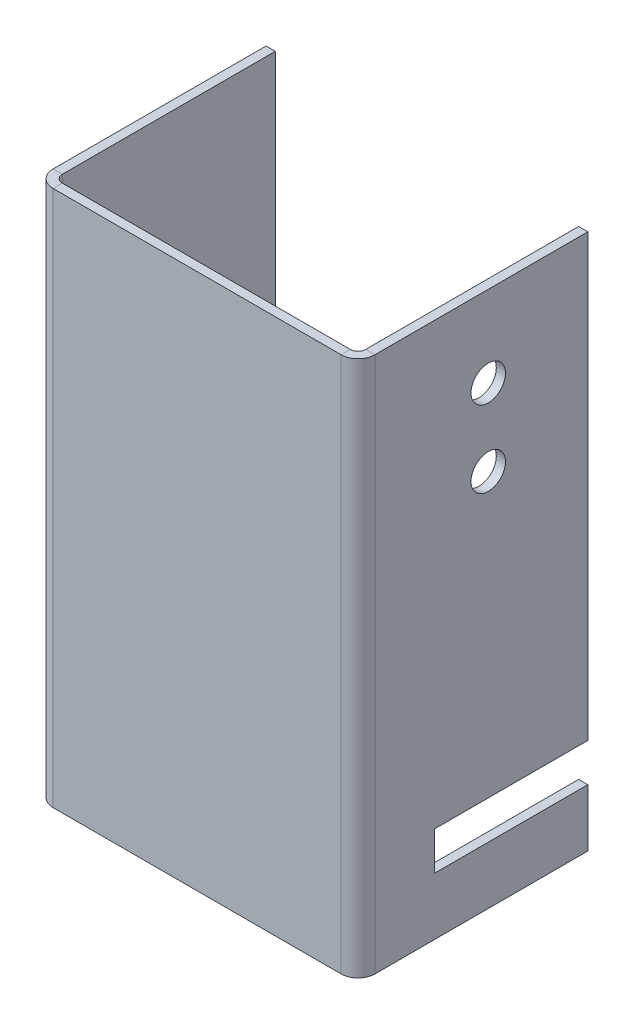
ISO-10303-21;
HEADER;
FILE_DESCRIPTION(('STEP AP214'),'2;1');
FILE_NAME('part.step','',(''),(''),'','','');
FILE_SCHEMA(('AUTOMOTIVE_DESIGN { 1 0 10303 214 1 1 1 1 }'));
ENDSEC;
DATA;
#1=APPLICATION_CONTEXT('core data for automotive mechanical design processes');
#2=APPLICATION_PROTOCOL_DEFINITION('international standard','automotive_design',2000,#1);
#3=PRODUCT_CONTEXT('',#1,'mechanical');
#4=PRODUCT('Part','Part','',(#3));
#5=PRODUCT_RELATED_PRODUCT_CATEGORY('part','',(#4));
#6=PRODUCT_DEFINITION_FORMATION('','',#4);
#7=PRODUCT_DEFINITION_CONTEXT('part definition',#1,'design');
#8=PRODUCT_DEFINITION('design','',#6,#7);
#9=PRODUCT_DEFINITION_SHAPE('','',#8);
#10=(LENGTH_UNIT() NAMED_UNIT(*) SI_UNIT(.MILLI.,.METRE.));
#11=(NAMED_UNIT(*) PLANE_ANGLE_UNIT() SI_UNIT($,.RADIAN.));
#12=(NAMED_UNIT(*) SI_UNIT($,.STERADIAN.) SOLID_ANGLE_UNIT());
#13=UNCERTAINTY_MEASURE_WITH_UNIT(LENGTH_MEASURE(1.E-05),#10,'distance_accuracy_value','');
#14=(GEOMETRIC_REPRESENTATION_CONTEXT(3) GLOBAL_UNCERTAINTY_ASSIGNED_CONTEXT((#13)) GLOBAL_UNIT_ASSIGNED_CONTEXT((#10,
#11,#12)) REPRESENTATION_CONTEXT('',''));
#15=CARTESIAN_POINT('',(0.,0.,0.));
#16=DIRECTION('',(0.,0.,1.));
#17=DIRECTION('',(1.,0.,0.));
#18=AXIS2_PLACEMENT_3D('',#15,#16,#17);
#19=CARTESIAN_POINT('',(42.,70.,-30.));
#20=DIRECTION('',(0.,0.,-1.));
#21=DIRECTION('',(0.,-1.,0.));
#22=AXIS2_PLACEMENT_3D('',#19,#20,#21);
#23=PLANE('',#22);
#24=DIRECTION('',(1.,0.,0.));
#25=VECTOR('',#24,1.);
#26=CARTESIAN_POINT('',(-0.001000000000001,12.5,-30.));
#27=LINE('',#26,#25);
#28=CARTESIAN_POINT('',(40.8,12.5,-30.));
#29=VERTEX_POINT('',#28);
#30=CARTESIAN_POINT('',(42.,12.5,-30.));
#31=VERTEX_POINT('',#30);
#32=EDGE_CURVE('E642',#29,#31,#27,.T.);
#33=ORIENTED_EDGE('',*,*,#32,.F.);
#34=DIRECTION('',(0.,1.,0.));
#35=VECTOR('',#34,1.);
#36=CARTESIAN_POINT('',(40.8,70.,-30.));
#37=LINE('',#36,#35);
#38=CARTESIAN_POINT('',(40.8,70.,-30.));
#39=VERTEX_POINT('',#38);
#40=EDGE_CURVE('E165',#39,#29,#37,.F.);
#41=ORIENTED_EDGE('',*,*,#40,.F.);
#42=DIRECTION('',(1.,0.,0.));
#43=VECTOR('',#42,1.);
#44=CARTESIAN_POINT('',(42.,70.,-30.));
#45=LINE('',#44,#43);
#46=CARTESIAN_POINT('',(42.,70.,-30.));
#47=VERTEX_POINT('',#46);
#48=EDGE_CURVE('E190',#39,#47,#45,.T.);
#49=ORIENTED_EDGE('',*,*,#48,.T.);
#50=DIRECTION('',(0.,-1.,0.));
#51=VECTOR('',#50,1.);
#52=CARTESIAN_POINT('',(42.,70.,-30.));
#53=LINE('',#52,#51);
#54=EDGE_CURVE('E270',#47,#31,#53,.T.);
#55=ORIENTED_EDGE('',*,*,#54,.T.);
#56=EDGE_LOOP('',(#33,#41,#49,#55));
#57=FACE_BOUND('',#56,.T.);
#58=ADVANCED_FACE('F37',(#57),#23,.T.);
#59=CARTESIAN_POINT('',(0.,0.,0.));
#60=DIRECTION('',(0.,1.,0.));
#61=DIRECTION('',(1.,0.,0.));
#62=AXIS2_PLACEMENT_3D('',#59,#60,#61);
#63=PLANE('',#62);
#64=DIRECTION('',(0.,0.,1.));
#65=VECTOR('',#64,1.);
#66=CARTESIAN_POINT('',(2.2,0.,0.));
#67=LINE('',#66,#65);
#68=CARTESIAN_POINT('',(2.2,0.,-1.2));
#69=VERTEX_POINT('',#68);
#70=CARTESIAN_POINT('',(2.2,0.,0.));
#71=VERTEX_POINT('',#70);
#72=EDGE_CURVE('E11',#69,#71,#67,.T.);
#73=ORIENTED_EDGE('',*,*,#72,.F.);
#74=DIRECTION('',(-1.,0.,0.));
#75=VECTOR('',#74,1.);
#76=CARTESIAN_POINT('',(0.,0.,-1.2));
#77=LINE('',#76,#75);
#78=CARTESIAN_POINT('',(39.8,0.,-1.2));
#79=VERTEX_POINT('',#78);
#80=EDGE_CURVE('E151',#69,#79,#77,.F.);
#81=ORIENTED_EDGE('',*,*,#80,.T.);
#82=DIRECTION('',(0.,0.,1.));
#83=VECTOR('',#82,1.);
#84=CARTESIAN_POINT('',(39.8,0.,0.));
#85=LINE('',#84,#83);
#86=CARTESIAN_POINT('',(39.8,0.,0.));
#87=VERTEX_POINT('',#86);
#88=EDGE_CURVE('E46',#79,#87,#85,.T.);
#89=ORIENTED_EDGE('',*,*,#88,.T.);
#90=DIRECTION('',(1.,0.,0.));
#91=VECTOR('',#90,1.);
#92=CARTESIAN_POINT('',(0.,0.,0.));
#93=LINE('',#92,#91);
#94=EDGE_CURVE('E276',#71,#87,#93,.T.);
#95=ORIENTED_EDGE('',*,*,#94,.F.);
#96=EDGE_LOOP('',(#73,#81,#89,#95));
#97=FACE_BOUND('',#96,.T.);
#98=ADVANCED_FACE('F324',(#97),#63,.F.);
#99=CARTESIAN_POINT('',(39.8,0.,-2.2));
#100=DIRECTION('',(0.,1.,0.));
#101=DIRECTION('',(0.,0.,1.));
#102=AXIS2_PLACEMENT_3D('',#99,#100,#101);
#103=PLANE('',#102);
#104=ORIENTED_EDGE('',*,*,#88,.F.);
#105=CARTESIAN_POINT('',(39.8,0.,-2.2));
#106=DIRECTION('',(0.,-1.,0.));
#107=DIRECTION('',(0.,0.,-1.));
#108=AXIS2_PLACEMENT_3D('',#105,#106,#107);
#109=CIRCLE('',#108,1.);
#110=CARTESIAN_POINT('',(40.8,0.,-2.2));
#111=VERTEX_POINT('',#110);
#112=EDGE_CURVE('E161',#79,#111,#109,.F.);
#113=ORIENTED_EDGE('',*,*,#112,.T.);
#114=DIRECTION('',(1.,0.,0.));
#115=VECTOR('',#114,1.);
#116=CARTESIAN_POINT('',(42.,0.,-2.2));
#117=LINE('',#116,#115);
#118=CARTESIAN_POINT('',(42.,0.,-2.2));
#119=VERTEX_POINT('',#118);
#120=EDGE_CURVE('E196',#111,#119,#117,.T.);
#121=ORIENTED_EDGE('',*,*,#120,.T.);
#122=CARTESIAN_POINT('',(39.8,0.,-2.2));
#123=DIRECTION('',(0.,-1.,0.));
#124=DIRECTION('',(0.,0.,-1.));
#125=AXIS2_PLACEMENT_3D('',#122,#123,#124);
#126=CIRCLE('',#125,2.2);
#127=EDGE_CURVE('E204',#87,#119,#126,.F.);
#128=ORIENTED_EDGE('',*,*,#127,.F.);
#129=EDGE_LOOP('',(#104,#113,#121,#128));
#130=FACE_BOUND('',#129,.T.);
#131=ADVANCED_FACE('F203',(#130),#103,.F.);
#132=CARTESIAN_POINT('',(42.,0.,0.));
#133=DIRECTION('',(0.,1.,0.));
#134=DIRECTION('',(0.,0.,-1.));
#135=AXIS2_PLACEMENT_3D('',#132,#133,#134);
#136=PLANE('',#135);
#137=ORIENTED_EDGE('',*,*,#120,.F.);
#138=DIRECTION('',(0.,0.,1.));
#139=VECTOR('',#138,1.);
#140=CARTESIAN_POINT('',(40.8,0.,0.));
#141=LINE('',#140,#139);
#142=CARTESIAN_POINT('',(40.8,0.,-30.));
#143=VERTEX_POINT('',#142);
#144=EDGE_CURVE('E157',#111,#143,#141,.F.);
#145=ORIENTED_EDGE('',*,*,#144,.T.);
#146=DIRECTION('',(1.,0.,0.));
#147=VECTOR('',#146,1.);
#148=CARTESIAN_POINT('',(42.,0.,-30.));
#149=LINE('',#148,#147);
#150=CARTESIAN_POINT('',(42.,0.,-30.));
#151=VERTEX_POINT('',#150);
#152=EDGE_CURVE('E193',#143,#151,#149,.T.);
#153=ORIENTED_EDGE('',*,*,#152,.T.);
#154=DIRECTION('',(0.,0.,-1.));
#155=VECTOR('',#154,1.);
#156=CARTESIAN_POINT('',(42.,0.,0.));
#157=LINE('',#156,#155);
#158=EDGE_CURVE('E223',#119,#151,#157,.T.);
#159=ORIENTED_EDGE('',*,*,#158,.F.);
#160=EDGE_LOOP('',(#137,#145,#153,#159));
#161=FACE_BOUND('',#160,.T.);
#162=ADVANCED_FACE('F224',(#161),#136,.F.);
#163=DIRECTION('',(1.,0.,0.));
#164=VECTOR('',#163,1.);
#165=CARTESIAN_POINT('',(-0.001000000000001,7.5,-30.));
#166=LINE('',#165,#164);
#167=CARTESIAN_POINT('',(40.8,7.50000000000001,-30.));
#168=VERTEX_POINT('',#167);
#169=CARTESIAN_POINT('',(42.,7.5,-30.));
#170=VERTEX_POINT('',#169);
#171=EDGE_CURVE('E53',#168,#170,#166,.T.);
#172=ORIENTED_EDGE('',*,*,#171,.T.);
#173=EDGE_CURVE('E228',#170,#151,#53,.T.);
#174=ORIENTED_EDGE('',*,*,#173,.T.);
#175=ORIENTED_EDGE('',*,*,#152,.F.);
#176=EDGE_CURVE('E168',#168,#143,#37,.F.);
#177=ORIENTED_EDGE('',*,*,#176,.F.);
#178=EDGE_LOOP('',(#172,#174,#175,#177));
#179=FACE_BOUND('',#178,.T.);
#180=ADVANCED_FACE('F265',(#179),#23,.T.);
#181=CARTESIAN_POINT('',(42.,70.,0.));
#182=DIRECTION('',(0.,1.,0.));
#183=DIRECTION('',(0.,0.,-1.));
#184=AXIS2_PLACEMENT_3D('',#181,#182,#183);
#185=PLANE('',#184);
#186=ORIENTED_EDGE('',*,*,#48,.F.);
#187=DIRECTION('',(0.,0.,1.));
#188=VECTOR('',#187,1.);
#189=CARTESIAN_POINT('',(40.8,70.,0.));
#190=LINE('',#189,#188);
#191=CARTESIAN_POINT('',(40.8,70.,-2.2));
#192=VERTEX_POINT('',#191);
#193=EDGE_CURVE('E162',#192,#39,#190,.F.);
#194=ORIENTED_EDGE('',*,*,#193,.F.);
#195=DIRECTION('',(1.,0.,0.));
#196=VECTOR('',#195,1.);
#197=CARTESIAN_POINT('',(42.,70.,-2.2));
#198=LINE('',#197,#196);
#199=CARTESIAN_POINT('',(42.,70.,-2.2));
#200=VERTEX_POINT('',#199);
#201=EDGE_CURVE('E187',#192,#200,#198,.T.);
#202=ORIENTED_EDGE('',*,*,#201,.T.);
#203=DIRECTION('',(0.,0.,-1.));
#204=VECTOR('',#203,1.);
#205=CARTESIAN_POINT('',(42.,70.,0.));
#206=LINE('',#205,#204);
#207=EDGE_CURVE('E236',#200,#47,#206,.T.);
#208=ORIENTED_EDGE('',*,*,#207,.T.);
#209=EDGE_LOOP('',(#186,#194,#202,#208));
#210=FACE_BOUND('',#209,.T.);
#211=ADVANCED_FACE('F315',(#210),#185,.T.);
#212=CARTESIAN_POINT('',(39.8,70.,-2.2));
#213=DIRECTION('',(0.,-1.,0.));
#214=DIRECTION('',(0.,0.,-1.));
#215=AXIS2_PLACEMENT_3D('',#212,#213,#214);
#216=PLANE('',#215);
#217=ORIENTED_EDGE('',*,*,#201,.F.);
#218=CARTESIAN_POINT('',(39.8,70.,-2.2));
#219=DIRECTION('',(0.,-1.,0.));
#220=DIRECTION('',(0.,0.,-1.));
#221=AXIS2_PLACEMENT_3D('',#218,#219,#220);
#222=CIRCLE('',#221,1.);
#223=CARTESIAN_POINT('',(39.8,70.,-1.2));
#224=VERTEX_POINT('',#223);
#225=EDGE_CURVE('E142',#192,#224,#222,.T.);
#226=ORIENTED_EDGE('',*,*,#225,.T.);
#227=DIRECTION('',(0.,0.,1.));
#228=VECTOR('',#227,1.);
#229=CARTESIAN_POINT('',(39.8,70.,0.));
#230=LINE('',#229,#228);
#231=CARTESIAN_POINT('',(39.8,70.,0.));
#232=VERTEX_POINT('',#231);
#233=EDGE_CURVE('E185',#224,#232,#230,.T.);
#234=ORIENTED_EDGE('',*,*,#233,.T.);
#235=CARTESIAN_POINT('',(39.8,70.,-2.2));
#236=DIRECTION('',(0.,1.,0.));
#237=DIRECTION('',(0.,0.,1.));
#238=AXIS2_PLACEMENT_3D('',#235,#236,#237);
#239=CIRCLE('',#238,2.2);
#240=EDGE_CURVE('E219',#200,#232,#239,.F.);
#241=ORIENTED_EDGE('',*,*,#240,.F.);
#242=EDGE_LOOP('',(#217,#226,#234,#241));
#243=FACE_BOUND('',#242,.T.);
#244=ADVANCED_FACE('F317',(#243),#216,.F.);
#245=CARTESIAN_POINT('',(0.,70.,0.));
#246=DIRECTION('',(0.,1.,0.));
#247=DIRECTION('',(1.,0.,0.));
#248=AXIS2_PLACEMENT_3D('',#245,#246,#247);
#249=PLANE('',#248);
#250=ORIENTED_EDGE('',*,*,#233,.F.);
#251=DIRECTION('',(-1.,0.,0.));
#252=VECTOR('',#251,1.);
#253=CARTESIAN_POINT('',(0.,70.,-1.2));
#254=LINE('',#253,#252);
#255=CARTESIAN_POINT('',(2.2,70.,-1.2));
#256=VERTEX_POINT('',#255);
#257=EDGE_CURVE('E146',#256,#224,#254,.F.);
#258=ORIENTED_EDGE('',*,*,#257,.F.);
#259=DIRECTION('',(0.,0.,1.));
#260=VECTOR('',#259,1.);
#261=CARTESIAN_POINT('',(2.2,70.,0.));
#262=LINE('',#261,#260);
#263=CARTESIAN_POINT('',(2.2,70.,0.));
#264=VERTEX_POINT('',#263);
#265=EDGE_CURVE('E182',#256,#264,#262,.T.);
#266=ORIENTED_EDGE('',*,*,#265,.T.);
#267=DIRECTION('',(1.,0.,0.));
#268=VECTOR('',#267,1.);
#269=CARTESIAN_POINT('',(0.,70.,0.));
#270=LINE('',#269,#268);
#271=EDGE_CURVE('E278',#264,#232,#270,.T.);
#272=ORIENTED_EDGE('',*,*,#271,.T.);
#273=EDGE_LOOP('',(#250,#258,#266,#272));
#274=FACE_BOUND('',#273,.T.);
#275=ADVANCED_FACE('F320',(#274),#249,.T.);
#276=CARTESIAN_POINT('',(2.2,70.,-2.2));
#277=DIRECTION('',(0.,-1.,0.));
#278=DIRECTION('',(0.,0.,-1.));
#279=AXIS2_PLACEMENT_3D('',#276,#277,#278);
#280=PLANE('',#279);
#281=ORIENTED_EDGE('',*,*,#265,.F.);
#282=CARTESIAN_POINT('',(2.2,70.,-2.2));
#283=DIRECTION('',(0.,-1.,0.));
#284=DIRECTION('',(0.,0.,-1.));
#285=AXIS2_PLACEMENT_3D('',#282,#283,#284);
#286=CIRCLE('',#285,1.);
#287=CARTESIAN_POINT('',(1.2,70.,-2.2));
#288=VERTEX_POINT('',#287);
#289=EDGE_CURVE('E141',#256,#288,#286,.T.);
#290=ORIENTED_EDGE('',*,*,#289,.T.);
#291=DIRECTION('',(-1.,0.,0.));
#292=VECTOR('',#291,1.);
#293=CARTESIAN_POINT('',(0.,70.,-2.2));
#294=LINE('',#293,#292);
#295=CARTESIAN_POINT('',(0.,70.,-2.2));
#296=VERTEX_POINT('',#295);
#297=EDGE_CURVE('E179',#288,#296,#294,.T.);
#298=ORIENTED_EDGE('',*,*,#297,.T.);
#299=CARTESIAN_POINT('',(2.2,70.,-2.2));
#300=DIRECTION('',(0.,1.,0.));
#301=DIRECTION('',(0.,0.,1.));
#302=AXIS2_PLACEMENT_3D('',#299,#300,#301);
#303=CIRCLE('',#302,2.2);
#304=EDGE_CURVE('E229',#264,#296,#303,.F.);
#305=ORIENTED_EDGE('',*,*,#304,.F.);
#306=EDGE_LOOP('',(#281,#290,#298,#305));
#307=FACE_BOUND('',#306,.T.);
#308=ADVANCED_FACE('F327',(#307),#280,.F.);
#309=CARTESIAN_POINT('',(0.,70.,0.));
#310=DIRECTION('',(0.,1.,0.));
#311=DIRECTION('',(0.,0.,1.));
#312=AXIS2_PLACEMENT_3D('',#309,#310,#311);
#313=PLANE('',#312);
#314=ORIENTED_EDGE('',*,*,#297,.F.);
#315=DIRECTION('',(0.,0.,-1.));
#316=VECTOR('',#315,1.);
#317=CARTESIAN_POINT('',(1.2,70.,0.));
#318=LINE('',#317,#316);
#319=CARTESIAN_POINT('',(1.2,70.,-30.));
#320=VERTEX_POINT('',#319);
#321=EDGE_CURVE('E130',#320,#288,#318,.F.);
#322=ORIENTED_EDGE('',*,*,#321,.F.);
#323=DIRECTION('',(-1.,0.,0.));
#324=VECTOR('',#323,1.);
#325=CARTESIAN_POINT('',(0.,70.,-30.));
#326=LINE('',#325,#324);
#327=CARTESIAN_POINT('',(0.,70.,-30.));
#328=VERTEX_POINT('',#327);
#329=EDGE_CURVE('E176',#320,#328,#326,.T.);
#330=ORIENTED_EDGE('',*,*,#329,.T.);
#331=DIRECTION('',(0.,0.,1.));
#332=VECTOR('',#331,1.);
#333=CARTESIAN_POINT('',(0.,70.,0.));
#334=LINE('',#333,#332);
#335=EDGE_CURVE('E283',#328,#296,#334,.T.);
#336=ORIENTED_EDGE('',*,*,#335,.T.);
#337=EDGE_LOOP('',(#314,#322,#330,#336));
#338=FACE_BOUND('',#337,.T.);
#339=ADVANCED_FACE('F301',(#338),#313,.T.);
#340=CARTESIAN_POINT('',(0.,70.,-30.));
#341=DIRECTION('',(0.,0.,1.));
#342=DIRECTION('',(0.,-1.,0.));
#343=AXIS2_PLACEMENT_3D('',#340,#341,#342);
#344=PLANE('',#343);
#345=ORIENTED_EDGE('',*,*,#329,.F.);
#346=DIRECTION('',(0.,1.,0.));
#347=VECTOR('',#346,1.);
#348=CARTESIAN_POINT('',(1.2,70.,-30.));
#349=LINE('',#348,#347);
#350=CARTESIAN_POINT('',(1.2,0.,-30.));
#351=VERTEX_POINT('',#350);
#352=EDGE_CURVE('E148',#320,#351,#349,.F.);
#353=ORIENTED_EDGE('',*,*,#352,.T.);
#354=DIRECTION('',(-1.,0.,0.));
#355=VECTOR('',#354,1.);
#356=CARTESIAN_POINT('',(0.,0.,-30.));
#357=LINE('',#356,#355);
#358=CARTESIAN_POINT('',(0.,0.,-30.));
#359=VERTEX_POINT('',#358);
#360=EDGE_CURVE('E118',#351,#359,#357,.T.);
#361=ORIENTED_EDGE('',*,*,#360,.T.);
#362=DIRECTION('',(0.,-1.,0.));
#363=VECTOR('',#362,1.);
#364=CARTESIAN_POINT('',(0.,70.,-30.));
#365=LINE('',#364,#363);
#366=EDGE_CURVE('E286',#328,#359,#365,.T.);
#367=ORIENTED_EDGE('',*,*,#366,.F.);
#368=EDGE_LOOP('',(#345,#353,#361,#367));
#369=FACE_BOUND('',#368,.T.);
#370=ADVANCED_FACE('F334',(#369),#344,.F.);
#371=CARTESIAN_POINT('',(0.,0.,0.));
#372=DIRECTION('',(0.,1.,0.));
#373=DIRECTION('',(0.,0.,1.));
#374=AXIS2_PLACEMENT_3D('',#371,#372,#373);
#375=PLANE('',#374);
#376=ORIENTED_EDGE('',*,*,#360,.F.);
#377=DIRECTION('',(0.,0.,-1.));
#378=VECTOR('',#377,1.);
#379=CARTESIAN_POINT('',(1.2,0.,0.));
#380=LINE('',#379,#378);
#381=CARTESIAN_POINT('',(1.2,0.,-2.2));
#382=VERTEX_POINT('',#381);
#383=EDGE_CURVE('E127',#351,#382,#380,.F.);
#384=ORIENTED_EDGE('',*,*,#383,.T.);
#385=DIRECTION('',(-1.,0.,0.));
#386=VECTOR('',#385,1.);
#387=CARTESIAN_POINT('',(0.,0.,-2.2));
#388=LINE('',#387,#386);
#389=CARTESIAN_POINT('',(0.,0.,-2.2));
#390=VERTEX_POINT('',#389);
#391=EDGE_CURVE('E41',#382,#390,#388,.T.);
#392=ORIENTED_EDGE('',*,*,#391,.T.);
#393=DIRECTION('',(0.,0.,1.));
#394=VECTOR('',#393,1.);
#395=CARTESIAN_POINT('',(0.,0.,0.));
#396=LINE('',#395,#394);
#397=EDGE_CURVE('E281',#359,#390,#396,.T.);
#398=ORIENTED_EDGE('',*,*,#397,.F.);
#399=EDGE_LOOP('',(#376,#384,#392,#398));
#400=FACE_BOUND('',#399,.T.);
#401=ADVANCED_FACE('F144',(#400),#375,.F.);
#402=CARTESIAN_POINT('',(2.2,0.,-2.2));
#403=DIRECTION('',(0.,1.,0.));
#404=DIRECTION('',(0.,0.,1.));
#405=AXIS2_PLACEMENT_3D('',#402,#403,#404);
#406=PLANE('',#405);
#407=CARTESIAN_POINT('',(2.2,0.,-2.2));
#408=DIRECTION('',(0.,-1.,0.));
#409=DIRECTION('',(0.,0.,-1.));
#410=AXIS2_PLACEMENT_3D('',#407,#408,#409);
#411=CIRCLE('',#410,1.);
#412=EDGE_CURVE('E109',#382,#69,#411,.F.);
#413=ORIENTED_EDGE('',*,*,#412,.T.);
#414=ORIENTED_EDGE('',*,*,#72,.T.);
#415=CARTESIAN_POINT('',(2.2,0.,-2.2));
#416=DIRECTION('',(0.,-1.,0.));
#417=DIRECTION('',(0.,0.,-1.));
#418=AXIS2_PLACEMENT_3D('',#415,#416,#417);
#419=CIRCLE('',#418,2.2);
#420=EDGE_CURVE('E112',#390,#71,#419,.F.);
#421=ORIENTED_EDGE('',*,*,#420,.F.);
#422=ORIENTED_EDGE('',*,*,#391,.F.);
#423=EDGE_LOOP('',(#413,#414,#421,#422));
#424=FACE_BOUND('',#423,.T.);
#425=ADVANCED_FACE('F39',(#424),#406,.F.);
#426=CARTESIAN_POINT('',(0.,70.,0.));
#427=DIRECTION('',(1.,0.,0.));
#428=DIRECTION('',(0.,0.,-1.));
#429=AXIS2_PLACEMENT_3D('',#426,#427,#428);
#430=PLANE('',#429);
#431=ORIENTED_EDGE('',*,*,#397,.T.);
#432=DIRECTION('',(0.,-1.,0.));
#433=VECTOR('',#432,1.);
#434=CARTESIAN_POINT('',(0.,70.,-2.2));
#435=LINE('',#434,#433);
#436=EDGE_CURVE('E238',#390,#296,#435,.F.);
#437=ORIENTED_EDGE('',*,*,#436,.T.);
#438=ORIENTED_EDGE('',*,*,#335,.F.);
#439=ORIENTED_EDGE('',*,*,#366,.T.);
#440=EDGE_LOOP('',(#431,#437,#438,#439));
#441=FACE_BOUND('',#440,.T.);
#442=ADVANCED_FACE('F305',(#441),#430,.F.);
#443=CARTESIAN_POINT('',(0.,70.,0.));
#444=DIRECTION('',(0.,0.,-1.));
#445=DIRECTION('',(-1.,0.,0.));
#446=AXIS2_PLACEMENT_3D('',#443,#444,#445);
#447=PLANE('',#446);
#448=ORIENTED_EDGE('',*,*,#94,.T.);
#449=DIRECTION('',(0.,-1.,0.));
#450=VECTOR('',#449,1.);
#451=CARTESIAN_POINT('',(39.8,70.,0.));
#452=LINE('',#451,#450);
#453=EDGE_CURVE('E119',#87,#232,#452,.F.);
#454=ORIENTED_EDGE('',*,*,#453,.T.);
#455=ORIENTED_EDGE('',*,*,#271,.F.);
#456=DIRECTION('',(0.,-1.,0.));
#457=VECTOR('',#456,1.);
#458=CARTESIAN_POINT('',(2.2,70.,0.));
#459=LINE('',#458,#457);
#460=EDGE_CURVE('E242',#264,#71,#459,.T.);
#461=ORIENTED_EDGE('',*,*,#460,.T.);
#462=EDGE_LOOP('',(#448,#454,#455,#461));
#463=FACE_BOUND('',#462,.T.);
#464=ADVANCED_FACE('F323',(#463),#447,.F.);
#465=CARTESIAN_POINT('',(42.,70.,0.));
#466=DIRECTION('',(-1.,0.,0.));
#467=DIRECTION('',(0.,0.,1.));
#468=AXIS2_PLACEMENT_3D('',#465,#466,#467);
#469=PLANE('',#468);
#470=CARTESIAN_POINT('',(42.,59.4,-17.));
#471=DIRECTION('',(1.,0.,0.));
#472=DIRECTION('',(0.,0.,-1.));
#473=AXIS2_PLACEMENT_3D('',#470,#471,#472);
#474=CIRCLE('',#473,2.25);
#475=CARTESIAN_POINT('',(42.,59.4,-19.25));
#476=VERTEX_POINT('',#475);
#477=EDGE_CURVE('E173',#476,#476,#474,.T.);
#478=ORIENTED_EDGE('',*,*,#477,.F.);
#479=EDGE_LOOP('',(#478));
#480=FACE_BOUND('',#479,.T.);
#481=CARTESIAN_POINT('',(42.,49.4,-17.));
#482=DIRECTION('',(1.,0.,0.));
#483=DIRECTION('',(0.,0.,-1.));
#484=AXIS2_PLACEMENT_3D('',#481,#482,#483);
#485=CIRCLE('',#484,2.25);
#486=CARTESIAN_POINT('',(42.,49.4,-19.25));
#487=VERTEX_POINT('',#486);
#488=EDGE_CURVE('E658',#487,#487,#485,.T.);
#489=ORIENTED_EDGE('',*,*,#488,.F.);
#490=EDGE_LOOP('',(#489));
#491=FACE_BOUND('',#490,.T.);
#492=DIRECTION('',(0.,-1.,0.));
#493=VECTOR('',#492,1.);
#494=CARTESIAN_POINT('',(42.,12.5,-10.));
#495=LINE('',#494,#493);
#496=CARTESIAN_POINT('',(42.,12.5,-10.));
#497=VERTEX_POINT('',#496);
#498=CARTESIAN_POINT('',(42.,7.5,-10.));
#499=VERTEX_POINT('',#498);
#500=EDGE_CURVE('E636',#497,#499,#495,.T.);
#501=ORIENTED_EDGE('',*,*,#500,.F.);
#502=DIRECTION('',(0.,0.,1.));
#503=VECTOR('',#502,1.);
#504=CARTESIAN_POINT('',(42.,12.5,-30.));
#505=LINE('',#504,#503);
#506=EDGE_CURVE('E640',#31,#497,#505,.T.);
#507=ORIENTED_EDGE('',*,*,#506,.F.);
#508=ORIENTED_EDGE('',*,*,#54,.F.);
#509=ORIENTED_EDGE('',*,*,#207,.F.);
#510=DIRECTION('',(0.,-1.,0.));
#511=VECTOR('',#510,1.);
#512=CARTESIAN_POINT('',(42.,70.,-2.2));
#513=LINE('',#512,#511);
#514=EDGE_CURVE('E217',#200,#119,#513,.T.);
#515=ORIENTED_EDGE('',*,*,#514,.T.);
#516=ORIENTED_EDGE('',*,*,#158,.T.);
#517=ORIENTED_EDGE('',*,*,#173,.F.);
#518=DIRECTION('',(0.,0.,-1.));
#519=VECTOR('',#518,1.);
#520=CARTESIAN_POINT('',(42.,7.5,-30.));
#521=LINE('',#520,#519);
#522=EDGE_CURVE('E628',#499,#170,#521,.T.);
#523=ORIENTED_EDGE('',*,*,#522,.F.);
#524=EDGE_LOOP('',(#501,#507,#508,#509,#515,#516,#517,#523));
#525=FACE_BOUND('',#524,.T.);
#526=ADVANCED_FACE('F233',(#480,#491,#525),#469,.F.);
#527=CARTESIAN_POINT('',(2.2,70.,-2.2));
#528=DIRECTION('',(0.,-1.,0.));
#529=DIRECTION('',(0.,0.,-1.));
#530=AXIS2_PLACEMENT_3D('',#527,#528,#529);
#531=CYLINDRICAL_SURFACE('',#530,2.2);
#532=ORIENTED_EDGE('',*,*,#304,.T.);
#533=ORIENTED_EDGE('',*,*,#436,.F.);
#534=ORIENTED_EDGE('',*,*,#420,.T.);
#535=ORIENTED_EDGE('',*,*,#460,.F.);
#536=EDGE_LOOP('',(#532,#533,#534,#535));
#537=FACE_BOUND('',#536,.T.);
#538=ADVANCED_FACE('F295',(#537),#531,.T.);
#539=CARTESIAN_POINT('',(39.8,70.,-2.2));
#540=DIRECTION('',(0.,-1.,0.));
#541=DIRECTION('',(0.,0.,-1.));
#542=AXIS2_PLACEMENT_3D('',#539,#540,#541);
#543=CYLINDRICAL_SURFACE('',#542,2.2);
#544=ORIENTED_EDGE('',*,*,#240,.T.);
#545=ORIENTED_EDGE('',*,*,#453,.F.);
#546=ORIENTED_EDGE('',*,*,#127,.T.);
#547=ORIENTED_EDGE('',*,*,#514,.F.);
#548=EDGE_LOOP('',(#544,#545,#546,#547));
#549=FACE_BOUND('',#548,.T.);
#550=ADVANCED_FACE('F215',(#549),#543,.T.);
#551=CARTESIAN_POINT('',(1.2,70.,0.));
#552=DIRECTION('',(1.,0.,0.));
#553=DIRECTION('',(0.,0.,-1.));
#554=AXIS2_PLACEMENT_3D('',#551,#552,#553);
#555=PLANE('',#554);
#556=ORIENTED_EDGE('',*,*,#383,.F.);
#557=ORIENTED_EDGE('',*,*,#352,.F.);
#558=ORIENTED_EDGE('',*,*,#321,.T.);
#559=DIRECTION('',(0.,1.,0.));
#560=VECTOR('',#559,1.);
#561=CARTESIAN_POINT('',(1.2,70.,-2.2));
#562=LINE('',#561,#560);
#563=EDGE_CURVE('E124',#382,#288,#562,.T.);
#564=ORIENTED_EDGE('',*,*,#563,.F.);
#565=EDGE_LOOP('',(#556,#557,#558,#564));
#566=FACE_BOUND('',#565,.T.);
#567=ADVANCED_FACE('F125',(#566),#555,.T.);
#568=CARTESIAN_POINT('',(0.,70.,-1.2));
#569=DIRECTION('',(0.,0.,-1.));
#570=DIRECTION('',(-1.,0.,0.));
#571=AXIS2_PLACEMENT_3D('',#568,#569,#570);
#572=PLANE('',#571);
#573=ORIENTED_EDGE('',*,*,#80,.F.);
#574=DIRECTION('',(0.,1.,0.));
#575=VECTOR('',#574,1.);
#576=CARTESIAN_POINT('',(2.2,70.,-1.2));
#577=LINE('',#576,#575);
#578=EDGE_CURVE('E135',#256,#69,#577,.F.);
#579=ORIENTED_EDGE('',*,*,#578,.F.);
#580=ORIENTED_EDGE('',*,*,#257,.T.);
#581=DIRECTION('',(0.,1.,0.));
#582=VECTOR('',#581,1.);
#583=CARTESIAN_POINT('',(39.8,70.,-1.2));
#584=LINE('',#583,#582);
#585=EDGE_CURVE('E220',#79,#224,#584,.T.);
#586=ORIENTED_EDGE('',*,*,#585,.F.);
#587=EDGE_LOOP('',(#573,#579,#580,#586));
#588=FACE_BOUND('',#587,.T.);
#589=ADVANCED_FACE('F326',(#588),#572,.T.);
#590=CARTESIAN_POINT('',(40.8,70.,0.));
#591=DIRECTION('',(-1.,0.,0.));
#592=DIRECTION('',(0.,0.,1.));
#593=AXIS2_PLACEMENT_3D('',#590,#591,#592);
#594=PLANE('',#593);
#595=DIRECTION('',(0.,0.,1.));
#596=VECTOR('',#595,1.);
#597=CARTESIAN_POINT('',(40.8,12.5,-30.));
#598=LINE('',#597,#596);
#599=CARTESIAN_POINT('',(40.8,12.5,-10.));
#600=VERTEX_POINT('',#599);
#601=EDGE_CURVE('E648',#29,#600,#598,.T.);
#602=ORIENTED_EDGE('',*,*,#601,.T.);
#603=DIRECTION('',(0.,-1.,0.));
#604=VECTOR('',#603,1.);
#605=CARTESIAN_POINT('',(40.8,12.5,-10.));
#606=LINE('',#605,#604);
#607=CARTESIAN_POINT('',(40.8,7.5,-10.));
#608=VERTEX_POINT('',#607);
#609=EDGE_CURVE('E670',#600,#608,#606,.T.);
#610=ORIENTED_EDGE('',*,*,#609,.T.);
#611=DIRECTION('',(0.,0.,-1.));
#612=VECTOR('',#611,1.);
#613=CARTESIAN_POINT('',(40.8,7.5,-30.));
#614=LINE('',#613,#612);
#615=EDGE_CURVE('E262',#608,#168,#614,.T.);
#616=ORIENTED_EDGE('',*,*,#615,.T.);
#617=ORIENTED_EDGE('',*,*,#176,.T.);
#618=ORIENTED_EDGE('',*,*,#144,.F.);
#619=DIRECTION('',(0.,1.,0.));
#620=VECTOR('',#619,1.);
#621=CARTESIAN_POINT('',(40.8,70.,-2.2));
#622=LINE('',#621,#620);
#623=EDGE_CURVE('E134',#192,#111,#622,.F.);
#624=ORIENTED_EDGE('',*,*,#623,.F.);
#625=ORIENTED_EDGE('',*,*,#193,.T.);
#626=ORIENTED_EDGE('',*,*,#40,.T.);
#627=EDGE_LOOP('',(#602,#610,#616,#617,#618,#624,#625,#626));
#628=FACE_BOUND('',#627,.T.);
#629=CARTESIAN_POINT('',(40.8,59.4,-17.));
#630=DIRECTION('',(-1.,0.,0.));
#631=DIRECTION('',(0.,0.,1.));
#632=AXIS2_PLACEMENT_3D('',#629,#630,#631);
#633=CIRCLE('',#632,2.25);
#634=CARTESIAN_POINT('',(40.8,59.4,-14.75));
#635=VERTEX_POINT('',#634);
#636=EDGE_CURVE('E655',#635,#635,#633,.F.);
#637=ORIENTED_EDGE('',*,*,#636,.T.);
#638=EDGE_LOOP('',(#637));
#639=FACE_BOUND('',#638,.T.);
#640=CARTESIAN_POINT('',(40.8,49.4,-17.));
#641=DIRECTION('',(-1.,0.,0.));
#642=DIRECTION('',(0.,0.,1.));
#643=AXIS2_PLACEMENT_3D('',#640,#641,#642);
#644=CIRCLE('',#643,2.25);
#645=CARTESIAN_POINT('',(40.8,49.4,-14.75));
#646=VERTEX_POINT('',#645);
#647=EDGE_CURVE('E652',#646,#646,#644,.F.);
#648=ORIENTED_EDGE('',*,*,#647,.T.);
#649=EDGE_LOOP('',(#648));
#650=FACE_BOUND('',#649,.T.);
#651=ADVANCED_FACE('F258',(#628,#639,#650),#594,.T.);
#652=CARTESIAN_POINT('',(2.2,70.,-2.2));
#653=DIRECTION('',(0.,-1.,0.));
#654=DIRECTION('',(0.,0.,-1.));
#655=AXIS2_PLACEMENT_3D('',#652,#653,#654);
#656=CYLINDRICAL_SURFACE('',#655,1.);
#657=ORIENTED_EDGE('',*,*,#289,.F.);
#658=ORIENTED_EDGE('',*,*,#578,.T.);
#659=ORIENTED_EDGE('',*,*,#412,.F.);
#660=ORIENTED_EDGE('',*,*,#563,.T.);
#661=EDGE_LOOP('',(#657,#658,#659,#660));
#662=FACE_BOUND('',#661,.T.);
#663=ADVANCED_FACE('F138',(#662),#656,.F.);
#664=CARTESIAN_POINT('',(39.8,70.,-2.2));
#665=DIRECTION('',(0.,-1.,0.));
#666=DIRECTION('',(0.,0.,-1.));
#667=AXIS2_PLACEMENT_3D('',#664,#665,#666);
#668=CYLINDRICAL_SURFACE('',#667,1.);
#669=ORIENTED_EDGE('',*,*,#225,.F.);
#670=ORIENTED_EDGE('',*,*,#623,.T.);
#671=ORIENTED_EDGE('',*,*,#112,.F.);
#672=ORIENTED_EDGE('',*,*,#585,.T.);
#673=EDGE_LOOP('',(#669,#670,#671,#672));
#674=FACE_BOUND('',#673,.T.);
#675=ADVANCED_FACE('F254',(#674),#668,.F.);
#676=CARTESIAN_POINT('',(-0.001000000000001,49.4,-17.));
#677=DIRECTION('',(1.,0.,0.));
#678=DIRECTION('',(0.,0.,-1.));
#679=AXIS2_PLACEMENT_3D('',#676,#677,#678);
#680=CYLINDRICAL_SURFACE('',#679,2.25);
#681=ORIENTED_EDGE('',*,*,#647,.F.);
#682=EDGE_LOOP('',(#681));
#683=FACE_BOUND('',#682,.T.);
#684=ORIENTED_EDGE('',*,*,#488,.T.);
#685=EDGE_LOOP('',(#684));
#686=FACE_BOUND('',#685,.T.);
#687=ADVANCED_FACE('F552',(#683,#686),#680,.F.);
#688=CARTESIAN_POINT('',(-0.001000000000001,59.4,-17.));
#689=DIRECTION('',(1.,0.,0.));
#690=DIRECTION('',(0.,0.,-1.));
#691=AXIS2_PLACEMENT_3D('',#688,#689,#690);
#692=CYLINDRICAL_SURFACE('',#691,2.25);
#693=ORIENTED_EDGE('',*,*,#636,.F.);
#694=EDGE_LOOP('',(#693));
#695=FACE_BOUND('',#694,.T.);
#696=ORIENTED_EDGE('',*,*,#477,.T.);
#697=EDGE_LOOP('',(#696));
#698=FACE_BOUND('',#697,.T.);
#699=ADVANCED_FACE('F561',(#695,#698),#692,.F.);
#700=CARTESIAN_POINT('',(-0.001000000000001,12.5,-30.));
#701=DIRECTION('',(0.,1.,0.));
#702=DIRECTION('',(0.,0.,1.));
#703=AXIS2_PLACEMENT_3D('',#700,#701,#702);
#704=PLANE('',#703);
#705=ORIENTED_EDGE('',*,*,#32,.T.);
#706=ORIENTED_EDGE('',*,*,#506,.T.);
#707=DIRECTION('',(1.,0.,0.));
#708=VECTOR('',#707,1.);
#709=CARTESIAN_POINT('',(-0.001000000000001,12.5,-10.));
#710=LINE('',#709,#708);
#711=EDGE_CURVE('E633',#600,#497,#710,.T.);
#712=ORIENTED_EDGE('',*,*,#711,.F.);
#713=ORIENTED_EDGE('',*,*,#601,.F.);
#714=EDGE_LOOP('',(#705,#706,#712,#713));
#715=FACE_BOUND('',#714,.T.);
#716=ADVANCED_FACE('F570',(#715),#704,.F.);
#717=CARTESIAN_POINT('',(-0.001000000000001,12.5,-10.));
#718=DIRECTION('',(0.,0.,1.));
#719=DIRECTION('',(1.,0.,0.));
#720=AXIS2_PLACEMENT_3D('',#717,#718,#719);
#721=PLANE('',#720);
#722=ORIENTED_EDGE('',*,*,#711,.T.);
#723=ORIENTED_EDGE('',*,*,#500,.T.);
#724=DIRECTION('',(1.,0.,0.));
#725=VECTOR('',#724,1.);
#726=CARTESIAN_POINT('',(-0.001000000000001,7.5,-10.));
#727=LINE('',#726,#725);
#728=EDGE_CURVE('E626',#608,#499,#727,.T.);
#729=ORIENTED_EDGE('',*,*,#728,.F.);
#730=ORIENTED_EDGE('',*,*,#609,.F.);
#731=EDGE_LOOP('',(#722,#723,#729,#730));
#732=FACE_BOUND('',#731,.T.);
#733=ADVANCED_FACE('F585',(#732),#721,.F.);
#734=CARTESIAN_POINT('',(-0.001000000000001,7.5,-30.));
#735=DIRECTION('',(0.,-1.,0.));
#736=DIRECTION('',(0.,0.,-1.));
#737=AXIS2_PLACEMENT_3D('',#734,#735,#736);
#738=PLANE('',#737);
#739=ORIENTED_EDGE('',*,*,#728,.T.);
#740=ORIENTED_EDGE('',*,*,#522,.T.);
#741=ORIENTED_EDGE('',*,*,#171,.F.);
#742=ORIENTED_EDGE('',*,*,#615,.F.);
#743=EDGE_LOOP('',(#739,#740,#741,#742));
#744=FACE_BOUND('',#743,.T.);
#745=ADVANCED_FACE('F594',(#744),#738,.F.);
#746=CLOSED_SHELL('',(#58,#98,#131,#162,#180,#211,#244,#275,#308,#339,#370,#401,#425,#442,#464,
#526,#538,#550,#567,#589,#651,#663,#675,#687,#699,#716,#733,#745));
#747=MANIFOLD_SOLID_BREP('B2',#746);
#748=ADVANCED_BREP_SHAPE_REPRESENTATION('',(#18,#747),#14);
#749=SHAPE_DEFINITION_REPRESENTATION(#9,#748);
ENDSEC;
END-ISO-10303-21;
